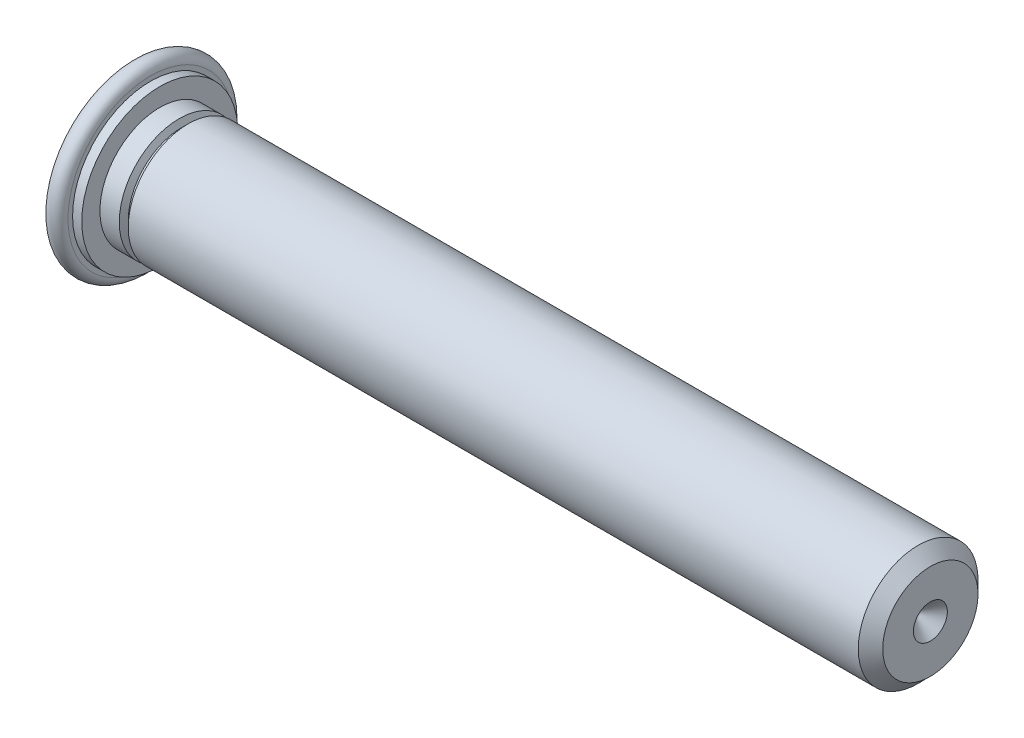
ISO-10303-21;
HEADER;
FILE_DESCRIPTION(('STEP AP214'),'2;1');
FILE_NAME('part.step','',(''),(''),'','','');
FILE_SCHEMA(('AUTOMOTIVE_DESIGN { 1 0 10303 214 1 1 1 1 }'));
ENDSEC;
DATA;
#1=APPLICATION_CONTEXT('core data for automotive mechanical design processes');
#2=APPLICATION_PROTOCOL_DEFINITION('international standard','automotive_design',2000,#1);
#3=PRODUCT_CONTEXT('',#1,'mechanical');
#4=PRODUCT('Part','Part','',(#3));
#5=PRODUCT_RELATED_PRODUCT_CATEGORY('part','',(#4));
#6=PRODUCT_DEFINITION_FORMATION('','',#4);
#7=PRODUCT_DEFINITION_CONTEXT('part definition',#1,'design');
#8=PRODUCT_DEFINITION('design','',#6,#7);
#9=PRODUCT_DEFINITION_SHAPE('','',#8);
#10=(LENGTH_UNIT() NAMED_UNIT(*) SI_UNIT(.MILLI.,.METRE.));
#11=(NAMED_UNIT(*) PLANE_ANGLE_UNIT() SI_UNIT($,.RADIAN.));
#12=(NAMED_UNIT(*) SI_UNIT($,.STERADIAN.) SOLID_ANGLE_UNIT());
#13=UNCERTAINTY_MEASURE_WITH_UNIT(LENGTH_MEASURE(1.E-05),#10,'distance_accuracy_value','');
#14=(GEOMETRIC_REPRESENTATION_CONTEXT(3) GLOBAL_UNCERTAINTY_ASSIGNED_CONTEXT((#13)) GLOBAL_UNIT_ASSIGNED_CONTEXT((#10,
#11,#12)) REPRESENTATION_CONTEXT('',''));
#15=CARTESIAN_POINT('',(0.,0.,0.));
#16=DIRECTION('',(0.,0.,1.));
#17=DIRECTION('',(1.,0.,0.));
#18=AXIS2_PLACEMENT_3D('',#15,#16,#17);
#19=CARTESIAN_POINT('',(20.0000108,0.,0.));
#20=DIRECTION('',(1.,0.,0.));
#21=DIRECTION('',(0.,0.,-1.));
#22=AXIS2_PLACEMENT_3D('',#19,#20,#21);
#23=CONICAL_SURFACE('',#22,0.42550022977,0.785398163397448);
#24=CARTESIAN_POINT('',(19.57451057023,0.,0.));
#25=VERTEX_POINT('',#24);
#26=VERTEX_LOOP('',#25);
#27=FACE_BOUND('',#26,.T.);
#28=CARTESIAN_POINT('',(20.0000108,0.,0.));
#29=DIRECTION('',(1.,0.,0.));
#30=DIRECTION('',(0.,0.,-1.));
#31=AXIS2_PLACEMENT_3D('',#28,#29,#30);
#32=CIRCLE('',#31,0.425500229769997);
#33=CARTESIAN_POINT('',(20.0000108,0.,-0.425500229769997));
#34=VERTEX_POINT('',#33);
#35=EDGE_CURVE('E20',#34,#34,#32,.F.);
#36=ORIENTED_EDGE('',*,*,#35,.F.);
#37=EDGE_LOOP('',(#36));
#38=FACE_BOUND('',#37,.T.);
#39=ADVANCED_FACE('F16',(#27,#38),#23,.F.);
#40=CARTESIAN_POINT('',(20.0000108,-1.2173706573798,1.19350064449));
#41=DIRECTION('',(1.,0.,0.));
#42=DIRECTION('',(0.,0.,-1.));
#43=AXIS2_PLACEMENT_3D('',#40,#41,#42);
#44=PLANE('',#43);
#45=CARTESIAN_POINT('',(20.0000108,0.,0.));
#46=DIRECTION('',(-1.,0.,0.));
#47=DIRECTION('',(0.,0.,1.));
#48=AXIS2_PLACEMENT_3D('',#45,#46,#47);
#49=CIRCLE('',#48,1.19350064449);
#50=CARTESIAN_POINT('',(20.0000108,0.,1.19350064449));
#51=VERTEX_POINT('',#50);
#52=EDGE_CURVE('E35',#51,#51,#49,.T.);
#53=ORIENTED_EDGE('',*,*,#52,.F.);
#54=EDGE_LOOP('',(#53));
#55=FACE_BOUND('',#54,.T.);
#56=ORIENTED_EDGE('',*,*,#35,.T.);
#57=EDGE_LOOP('',(#56));
#58=FACE_BOUND('',#57,.T.);
#59=ADVANCED_FACE('F30',(#55,#58),#44,.T.);
#60=CARTESIAN_POINT('',(19.69351063449,0.,0.));
#61=DIRECTION('',(-1.,0.,0.));
#62=DIRECTION('',(0.,0.,1.));
#63=AXIS2_PLACEMENT_3D('',#60,#61,#62);
#64=CONICAL_SURFACE('',#63,1.50000081,0.785398163397449);
#65=CARTESIAN_POINT('',(19.69351063449,0.,0.));
#66=DIRECTION('',(-1.,0.,0.));
#67=DIRECTION('',(0.,0.,1.));
#68=AXIS2_PLACEMENT_3D('',#65,#66,#67);
#69=CIRCLE('',#68,1.50000081);
#70=CARTESIAN_POINT('',(19.69351063449,0.,1.50000081));
#71=VERTEX_POINT('',#70);
#72=EDGE_CURVE('E37',#71,#71,#69,.T.);
#73=ORIENTED_EDGE('',*,*,#72,.F.);
#74=EDGE_LOOP('',(#73));
#75=FACE_BOUND('',#74,.T.);
#76=ORIENTED_EDGE('',*,*,#52,.T.);
#77=EDGE_LOOP('',(#76));
#78=FACE_BOUND('',#77,.T.);
#79=ADVANCED_FACE('F149',(#75,#78),#64,.T.);
#80=CARTESIAN_POINT('',(1.400000756,0.,0.));
#81=DIRECTION('',(1.,0.,0.));
#82=DIRECTION('',(0.,0.,-1.));
#83=AXIS2_PLACEMENT_3D('',#80,#81,#82);
#84=CYLINDRICAL_SURFACE('',#83,1.50000081);
#85=CARTESIAN_POINT('',(1.400000756,0.,0.));
#86=DIRECTION('',(-1.,0.,0.));
#87=DIRECTION('',(0.,0.,1.));
#88=AXIS2_PLACEMENT_3D('',#85,#86,#87);
#89=CIRCLE('',#88,1.50000081);
#90=CARTESIAN_POINT('',(1.400000756,0.,1.50000081));
#91=VERTEX_POINT('',#90);
#92=EDGE_CURVE('E41',#91,#91,#89,.T.);
#93=ORIENTED_EDGE('',*,*,#92,.F.);
#94=EDGE_LOOP('',(#93));
#95=FACE_BOUND('',#94,.T.);
#96=ORIENTED_EDGE('',*,*,#72,.T.);
#97=EDGE_LOOP('',(#96));
#98=FACE_BOUND('',#97,.T.);
#99=ADVANCED_FACE('F141',(#95,#98),#84,.T.);
#100=CARTESIAN_POINT('',(1.3250007155,0.,0.));
#101=DIRECTION('',(1.,0.,0.));
#102=DIRECTION('',(0.,0.,-1.));
#103=AXIS2_PLACEMENT_3D('',#100,#101,#102);
#104=CONICAL_SURFACE('',#103,1.350000729,1.10714871779409);
#105=ORIENTED_EDGE('',*,*,#92,.T.);
#106=EDGE_LOOP('',(#105));
#107=FACE_BOUND('',#106,.T.);
#108=CARTESIAN_POINT('',(1.32500071545227,0.,0.));
#109=DIRECTION('',(-1.,0.,0.));
#110=DIRECTION('',(0.,0.,1.));
#111=AXIS2_PLACEMENT_3D('',#108,#109,#110);
#112=CIRCLE('',#111,1.35000072908788);
#113=CARTESIAN_POINT('',(1.32500071545227,0.,1.35000072908788));
#114=VERTEX_POINT('',#113);
#115=EDGE_CURVE('E48',#114,#114,#112,.T.);
#116=ORIENTED_EDGE('',*,*,#115,.F.);
#117=EDGE_LOOP('',(#116));
#118=FACE_BOUND('',#117,.T.);
#119=ADVANCED_FACE('F133',(#107,#118),#104,.T.);
#120=CARTESIAN_POINT('',(0.,-2.111401140156,-2.0700011178));
#121=DIRECTION('',(-1.,0.,0.));
#122=DIRECTION('',(0.,0.,1.));
#123=AXIS2_PLACEMENT_3D('',#120,#121,#122);
#124=PLANE('',#123);
#125=CARTESIAN_POINT('',(0.,0.,0.));
#126=DIRECTION('',(1.,0.,0.));
#127=DIRECTION('',(0.,0.,-1.));
#128=AXIS2_PLACEMENT_3D('',#125,#126,#127);
#129=CIRCLE('',#128,2.0700079001343);
#130=CARTESIAN_POINT('',(0.,0.,-2.0700079001343));
#131=VERTEX_POINT('',#130);
#132=EDGE_CURVE('E44',#131,#131,#129,.T.);
#133=ORIENTED_EDGE('',*,*,#132,.F.);
#134=EDGE_LOOP('',(#133));
#135=FACE_BOUND('',#134,.T.);
#136=ADVANCED_FACE('F82',(#135),#124,.T.);
#137=CARTESIAN_POINT('',(1.28750069525,0.,0.));
#138=DIRECTION('',(1.,0.,0.));
#139=DIRECTION('',(0.,0.,-1.));
#140=AXIS2_PLACEMENT_3D('',#137,#138,#139);
#141=TOROIDAL_SURFACE('',#140,1.4149526694733,0.0750000404999998);
#142=ORIENTED_EDGE('',*,*,#115,.T.);
#143=EDGE_LOOP('',(#142));
#144=FACE_BOUND('',#143,.T.);
#145=CARTESIAN_POINT('',(1.25000067501268,0.,0.));
#146=DIRECTION('',(-1.,0.,0.));
#147=DIRECTION('',(0.,0.,1.));
#148=AXIS2_PLACEMENT_3D('',#145,#146,#147);
#149=CIRCLE('',#148,1.35000072906794);
#150=CARTESIAN_POINT('',(1.25000067501268,0.,1.35000072906794));
#151=VERTEX_POINT('',#150);
#152=EDGE_CURVE('E47',#151,#151,#149,.T.);
#153=ORIENTED_EDGE('',*,*,#152,.F.);
#154=EDGE_LOOP('',(#153));
#155=FACE_BOUND('',#154,.T.);
#156=ADVANCED_FACE('F72',(#144,#155),#141,.F.);
#157=CARTESIAN_POINT('',(1.1750006345373,0.,0.));
#158=DIRECTION('',(-1.,0.,0.));
#159=DIRECTION('',(0.,0.,1.));
#160=AXIS2_PLACEMENT_3D('',#157,#158,#159);
#161=CONICAL_SURFACE('',#160,1.5000008100187,1.10714871779409);
#162=ORIENTED_EDGE('',*,*,#152,.T.);
#163=EDGE_LOOP('',(#162));
#164=FACE_BOUND('',#163,.T.);
#165=CARTESIAN_POINT('',(1.1750006345467,0.,0.));
#166=DIRECTION('',(-1.,0.,0.));
#167=DIRECTION('',(0.,0.,1.));
#168=AXIS2_PLACEMENT_3D('',#165,#166,#167);
#169=CIRCLE('',#168,1.50000081);
#170=CARTESIAN_POINT('',(1.1750006345467,0.,1.50000081));
#171=VERTEX_POINT('',#170);
#172=EDGE_CURVE('E53',#171,#171,#169,.T.);
#173=ORIENTED_EDGE('',*,*,#172,.F.);
#174=EDGE_LOOP('',(#173));
#175=FACE_BOUND('',#174,.T.);
#176=ADVANCED_FACE('F69',(#164,#175),#161,.T.);
#177=CARTESIAN_POINT('',(0.2300001242,0.,0.));
#178=DIRECTION('',(1.,0.,0.));
#179=DIRECTION('',(0.,0.,-1.));
#180=AXIS2_PLACEMENT_3D('',#177,#178,#179);
#181=TOROIDAL_SURFACE('',#180,2.0700079001343,0.2300001242);
#182=ORIENTED_EDGE('',*,*,#132,.T.);
#183=EDGE_LOOP('',(#182));
#184=FACE_BOUND('',#183,.T.);
#185=CARTESIAN_POINT('',(0.4600002483,0.,0.));
#186=DIRECTION('',(1.,0.,0.));
#187=DIRECTION('',(0.,0.,-1.));
#188=AXIS2_PLACEMENT_3D('',#185,#186,#187);
#189=CIRCLE('',#188,2.0700011178);
#190=CARTESIAN_POINT('',(0.4600002483,0.,-2.0700011178));
#191=VERTEX_POINT('',#190);
#192=EDGE_CURVE('E49',#191,#191,#189,.T.);
#193=ORIENTED_EDGE('',*,*,#192,.F.);
#194=EDGE_LOOP('',(#193));
#195=FACE_BOUND('',#194,.T.);
#196=ADVANCED_FACE('F71',(#184,#195),#181,.T.);
#197=CARTESIAN_POINT('',(0.6900003726,0.,0.));
#198=DIRECTION('',(1.,0.,0.));
#199=DIRECTION('',(0.,0.,-1.));
#200=AXIS2_PLACEMENT_3D('',#197,#198,#199);
#201=CYLINDRICAL_SURFACE('',#200,1.50000081);
#202=CARTESIAN_POINT('',(0.6900003726,0.,0.));
#203=DIRECTION('',(1.,0.,0.));
#204=DIRECTION('',(0.,0.,-1.));
#205=AXIS2_PLACEMENT_3D('',#202,#203,#204);
#206=CIRCLE('',#205,1.50000081);
#207=CARTESIAN_POINT('',(0.6900003726,0.,-1.50000081));
#208=VERTEX_POINT('',#207);
#209=EDGE_CURVE('E52',#208,#208,#206,.F.);
#210=ORIENTED_EDGE('',*,*,#209,.F.);
#211=EDGE_LOOP('',(#210));
#212=FACE_BOUND('',#211,.T.);
#213=ORIENTED_EDGE('',*,*,#172,.T.);
#214=EDGE_LOOP('',(#213));
#215=FACE_BOUND('',#214,.T.);
#216=ADVANCED_FACE('F67',(#212,#215),#201,.T.);
#217=CARTESIAN_POINT('',(0.46000024835,-2.111401140156,2.0700011178));
#218=DIRECTION('',(1.,0.,0.));
#219=DIRECTION('',(0.,0.,-1.));
#220=AXIS2_PLACEMENT_3D('',#217,#218,#219);
#221=PLANE('',#220);
#222=CARTESIAN_POINT('',(0.46000024835,0.,0.));
#223=DIRECTION('',(-1.,0.,0.));
#224=DIRECTION('',(0.,0.,1.));
#225=AXIS2_PLACEMENT_3D('',#222,#223,#224);
#226=CIRCLE('',#225,1.9550010557);
#227=CARTESIAN_POINT('',(0.46000024835,0.,1.9550010557));
#228=VERTEX_POINT('',#227);
#229=EDGE_CURVE('E24',#228,#228,#226,.F.);
#230=ORIENTED_EDGE('',*,*,#229,.F.);
#231=EDGE_LOOP('',(#230));
#232=FACE_BOUND('',#231,.T.);
#233=ORIENTED_EDGE('',*,*,#192,.T.);
#234=EDGE_LOOP('',(#233));
#235=FACE_BOUND('',#234,.T.);
#236=ADVANCED_FACE('F91',(#232,#235),#221,.T.);
#237=CARTESIAN_POINT('',(0.6900003726,1.994101076814,-1.9550010557));
#238=DIRECTION('',(1.,0.,0.));
#239=DIRECTION('',(0.,0.,1.));
#240=AXIS2_PLACEMENT_3D('',#237,#238,#239);
#241=PLANE('',#240);
#242=CARTESIAN_POINT('',(0.6900003726,0.,0.));
#243=DIRECTION('',(-1.,0.,0.));
#244=DIRECTION('',(0.,0.,1.));
#245=AXIS2_PLACEMENT_3D('',#242,#243,#244);
#246=CIRCLE('',#245,1.9550010557);
#247=CARTESIAN_POINT('',(0.6900003726,0.,1.9550010557));
#248=VERTEX_POINT('',#247);
#249=EDGE_CURVE('E10',#248,#248,#246,.T.);
#250=ORIENTED_EDGE('',*,*,#249,.F.);
#251=EDGE_LOOP('',(#250));
#252=FACE_BOUND('',#251,.T.);
#253=ORIENTED_EDGE('',*,*,#209,.T.);
#254=EDGE_LOOP('',(#253));
#255=FACE_BOUND('',#254,.T.);
#256=ADVANCED_FACE('F86',(#252,#255),#241,.T.);
#257=CARTESIAN_POINT('',(0.6900003726,0.,0.));
#258=DIRECTION('',(-1.,0.,0.));
#259=DIRECTION('',(0.,0.,1.));
#260=AXIS2_PLACEMENT_3D('',#257,#258,#259);
#261=CYLINDRICAL_SURFACE('',#260,1.9550010557);
#262=ORIENTED_EDGE('',*,*,#249,.T.);
#263=EDGE_LOOP('',(#262));
#264=FACE_BOUND('',#263,.T.);
#265=ORIENTED_EDGE('',*,*,#229,.T.);
#266=EDGE_LOOP('',(#265));
#267=FACE_BOUND('',#266,.T.);
#268=ADVANCED_FACE('F18',(#264,#267),#261,.T.);
#269=CLOSED_SHELL('',(#39,#59,#79,#99,#119,#136,#156,#176,#196,#216,#236,#256,#268));
#270=MANIFOLD_SOLID_BREP('B1',#269);
#271=ADVANCED_BREP_SHAPE_REPRESENTATION('',(#18,#270),#14);
#272=SHAPE_DEFINITION_REPRESENTATION(#9,#271);
ENDSEC;
END-ISO-10303-21;
